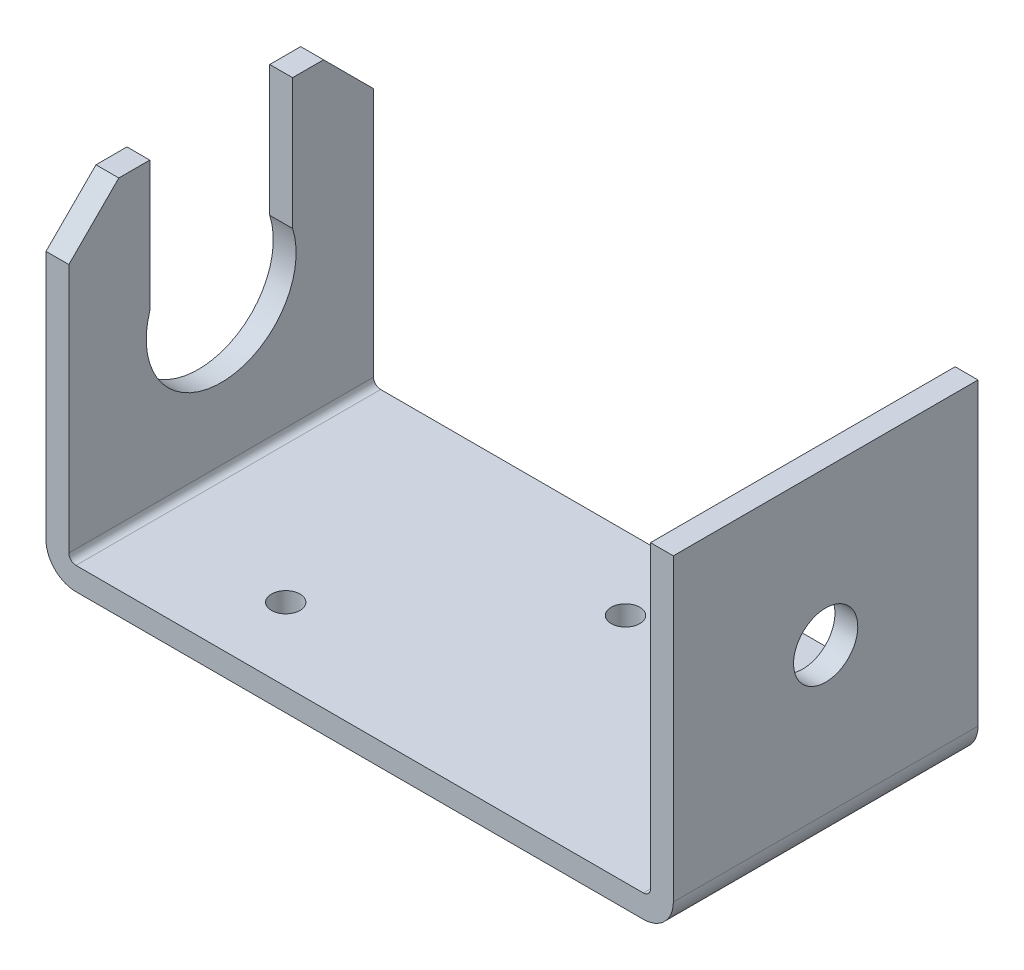
ISO-10303-21;
HEADER;
FILE_DESCRIPTION(('STEP AP214'),'2;1');
FILE_NAME('part.step','',(''),(''),'','','');
FILE_SCHEMA(('AUTOMOTIVE_DESIGN { 1 0 10303 214 1 1 1 1 }'));
ENDSEC;
DATA;
#1=APPLICATION_CONTEXT('core data for automotive mechanical design processes');
#2=APPLICATION_PROTOCOL_DEFINITION('international standard','automotive_design',2000,#1);
#3=PRODUCT_CONTEXT('',#1,'mechanical');
#4=PRODUCT('Part','Part','',(#3));
#5=PRODUCT_RELATED_PRODUCT_CATEGORY('part','',(#4));
#6=PRODUCT_DEFINITION_FORMATION('','',#4);
#7=PRODUCT_DEFINITION_CONTEXT('part definition',#1,'design');
#8=PRODUCT_DEFINITION('design','',#6,#7);
#9=PRODUCT_DEFINITION_SHAPE('','',#8);
#10=(LENGTH_UNIT() NAMED_UNIT(*) SI_UNIT(.MILLI.,.METRE.));
#11=(NAMED_UNIT(*) PLANE_ANGLE_UNIT() SI_UNIT($,.RADIAN.));
#12=(NAMED_UNIT(*) SI_UNIT($,.STERADIAN.) SOLID_ANGLE_UNIT());
#13=UNCERTAINTY_MEASURE_WITH_UNIT(LENGTH_MEASURE(1.E-05),#10,'distance_accuracy_value','');
#14=(GEOMETRIC_REPRESENTATION_CONTEXT(3) GLOBAL_UNCERTAINTY_ASSIGNED_CONTEXT((#13)) GLOBAL_UNIT_ASSIGNED_CONTEXT((#10,
#11,#12)) REPRESENTATION_CONTEXT('',''));
#15=CARTESIAN_POINT('',(0.,0.,0.));
#16=DIRECTION('',(0.,0.,1.));
#17=DIRECTION('',(1.,0.,0.));
#18=AXIS2_PLACEMENT_3D('',#15,#16,#17);
#19=CARTESIAN_POINT('',(20.37,10.75,21.34));
#20=DIRECTION('',(0.,-1.,0.));
#21=DIRECTION('',(0.,0.,-1.));
#22=AXIS2_PLACEMENT_3D('',#19,#20,#21);
#23=PLANE('',#22);
#24=DIRECTION('',(1.,0.,0.));
#25=VECTOR('',#24,1.);
#26=CARTESIAN_POINT('',(20.37,10.75,21.34));
#27=LINE('',#26,#25);
#28=CARTESIAN_POINT('',(21.97,10.75,21.34));
#29=VERTEX_POINT('',#28);
#30=CARTESIAN_POINT('',(20.37,10.75,21.34));
#31=VERTEX_POINT('',#30);
#32=EDGE_CURVE('E221',#29,#31,#27,.F.);
#33=ORIENTED_EDGE('',*,*,#32,.F.);
#34=DIRECTION('',(0.,0.,1.));
#35=VECTOR('',#34,1.);
#36=CARTESIAN_POINT('',(21.97,10.75,21.34));
#37=LINE('',#36,#35);
#38=CARTESIAN_POINT('',(21.97,10.75,0.));
#39=VERTEX_POINT('',#38);
#40=EDGE_CURVE('E300',#29,#39,#37,.F.);
#41=ORIENTED_EDGE('',*,*,#40,.T.);
#42=DIRECTION('',(1.,0.,0.));
#43=VECTOR('',#42,1.);
#44=CARTESIAN_POINT('',(20.37,10.75,0.));
#45=LINE('',#44,#43);
#46=CARTESIAN_POINT('',(20.37,10.75,0.));
#47=VERTEX_POINT('',#46);
#48=EDGE_CURVE('E153',#47,#39,#45,.T.);
#49=ORIENTED_EDGE('',*,*,#48,.F.);
#50=DIRECTION('',(0.,0.,1.));
#51=VECTOR('',#50,1.);
#52=CARTESIAN_POINT('',(20.37,10.75,21.34));
#53=LINE('',#52,#51);
#54=EDGE_CURVE('E311',#47,#31,#53,.T.);
#55=ORIENTED_EDGE('',*,*,#54,.T.);
#56=EDGE_LOOP('',(#33,#41,#49,#55));
#57=FACE_BOUND('',#56,.T.);
#58=ADVANCED_FACE('F16',(#57),#23,.F.);
#59=CARTESIAN_POINT('',(11.97,0.,10.67));
#60=DIRECTION('',(1.,0.,0.));
#61=DIRECTION('',(0.,1.,0.));
#62=AXIS2_PLACEMENT_3D('',#59,#60,#61);
#63=CYLINDRICAL_SURFACE('',#62,2.25);
#64=CARTESIAN_POINT('',(20.37,0.,10.67));
#65=DIRECTION('',(1.,0.,0.));
#66=DIRECTION('',(0.,1.,0.));
#67=AXIS2_PLACEMENT_3D('',#64,#65,#66);
#68=CIRCLE('',#67,2.25);
#69=CARTESIAN_POINT('',(20.37,2.25000000000001,10.67));
#70=VERTEX_POINT('',#69);
#71=EDGE_CURVE('E19',#70,#70,#68,.F.);
#72=ORIENTED_EDGE('',*,*,#71,.T.);
#73=EDGE_LOOP('',(#72));
#74=FACE_BOUND('',#73,.T.);
#75=CARTESIAN_POINT('',(21.97,0.,10.67));
#76=DIRECTION('',(1.,0.,0.));
#77=DIRECTION('',(0.,1.,0.));
#78=AXIS2_PLACEMENT_3D('',#75,#76,#77);
#79=CIRCLE('',#78,2.25);
#80=CARTESIAN_POINT('',(21.97,2.25000000000001,10.67));
#81=VERTEX_POINT('',#80);
#82=EDGE_CURVE('E296',#81,#81,#79,.T.);
#83=ORIENTED_EDGE('',*,*,#82,.T.);
#84=EDGE_LOOP('',(#83));
#85=FACE_BOUND('',#84,.T.);
#86=ADVANCED_FACE('F538',(#74,#85),#63,.F.);
#87=CARTESIAN_POINT('',(-21.97,10.75,21.34));
#88=DIRECTION('',(0.,-1.,0.));
#89=DIRECTION('',(0.,0.,-1.));
#90=AXIS2_PLACEMENT_3D('',#87,#88,#89);
#91=PLANE('',#90);
#92=DIRECTION('',(0.,0.,1.));
#93=VECTOR('',#92,1.);
#94=CARTESIAN_POINT('',(-20.37,10.75,21.34));
#95=LINE('',#94,#93);
#96=CARTESIAN_POINT('',(-20.37,10.75,17.84));
#97=VERTEX_POINT('',#96);
#98=CARTESIAN_POINT('',(-20.37,10.75,15.67));
#99=VERTEX_POINT('',#98);
#100=EDGE_CURVE('E345',#97,#99,#95,.F.);
#101=ORIENTED_EDGE('',*,*,#100,.T.);
#102=DIRECTION('',(1.,0.,0.));
#103=VECTOR('',#102,1.);
#104=CARTESIAN_POINT('',(-30.37,10.75,15.67));
#105=LINE('',#104,#103);
#106=CARTESIAN_POINT('',(-21.97,10.75,15.67));
#107=VERTEX_POINT('',#106);
#108=EDGE_CURVE('E218',#99,#107,#105,.F.);
#109=ORIENTED_EDGE('',*,*,#108,.T.);
#110=DIRECTION('',(0.,0.,-1.));
#111=VECTOR('',#110,1.);
#112=CARTESIAN_POINT('',(-21.97,10.75,21.34));
#113=LINE('',#112,#111);
#114=CARTESIAN_POINT('',(-21.97,10.75,17.84));
#115=VERTEX_POINT('',#114);
#116=EDGE_CURVE('E224',#107,#115,#113,.F.);
#117=ORIENTED_EDGE('',*,*,#116,.T.);
#118=DIRECTION('',(1.,0.,0.));
#119=VECTOR('',#118,1.);
#120=CARTESIAN_POINT('',(-19.87,10.75,17.84));
#121=LINE('',#120,#119);
#122=EDGE_CURVE('E318',#115,#97,#121,.T.);
#123=ORIENTED_EDGE('',*,*,#122,.T.);
#124=EDGE_LOOP('',(#101,#109,#117,#123));
#125=FACE_BOUND('',#124,.T.);
#126=ADVANCED_FACE('F478',(#125),#91,.F.);
#127=CARTESIAN_POINT('',(-30.37,13.3513775928379,15.67));
#128=DIRECTION('',(0.,0.,1.));
#129=DIRECTION('',(1.,0.,0.));
#130=AXIS2_PLACEMENT_3D('',#127,#128,#129);
#131=PLANE('',#130);
#132=DIRECTION('',(0.,1.,0.));
#133=VECTOR('',#132,1.);
#134=CARTESIAN_POINT('',(-21.97,10.75,15.67));
#135=LINE('',#134,#133);
#136=CARTESIAN_POINT('',(-21.97,1.6007810593582,15.67));
#137=VERTEX_POINT('',#136);
#138=EDGE_CURVE('E229',#137,#107,#135,.T.);
#139=ORIENTED_EDGE('',*,*,#138,.T.);
#140=ORIENTED_EDGE('',*,*,#108,.F.);
#141=DIRECTION('',(0.,-1.,0.));
#142=VECTOR('',#141,1.);
#143=CARTESIAN_POINT('',(-20.37,10.75,15.67));
#144=LINE('',#143,#142);
#145=CARTESIAN_POINT('',(-20.37,1.6007810593582,15.67));
#146=VERTEX_POINT('',#145);
#147=EDGE_CURVE('E293',#99,#146,#144,.T.);
#148=ORIENTED_EDGE('',*,*,#147,.T.);
#149=DIRECTION('',(1.,0.,0.));
#150=VECTOR('',#149,1.);
#151=CARTESIAN_POINT('',(-30.37,1.6007810593582,15.67));
#152=LINE('',#151,#150);
#153=EDGE_CURVE('E215',#146,#137,#152,.F.);
#154=ORIENTED_EDGE('',*,*,#153,.T.);
#155=EDGE_LOOP('',(#139,#140,#148,#154));
#156=FACE_BOUND('',#155,.T.);
#157=ADVANCED_FACE('F546',(#156),#131,.F.);
#158=CARTESIAN_POINT('',(-30.37,0.,10.67));
#159=DIRECTION('',(1.,0.,0.));
#160=DIRECTION('',(0.,1.,0.));
#161=AXIS2_PLACEMENT_3D('',#158,#159,#160);
#162=CYLINDRICAL_SURFACE('',#161,5.25);
#163=DIRECTION('',(1.,0.,0.));
#164=VECTOR('',#163,1.);
#165=CARTESIAN_POINT('',(-30.37,1.6007810593582,5.67));
#166=LINE('',#165,#164);
#167=CARTESIAN_POINT('',(-20.37,1.60078105935821,5.67));
#168=VERTEX_POINT('',#167);
#169=CARTESIAN_POINT('',(-21.97,1.6007810593582,5.67));
#170=VERTEX_POINT('',#169);
#171=EDGE_CURVE('E114',#168,#170,#166,.F.);
#172=ORIENTED_EDGE('',*,*,#171,.T.);
#173=CARTESIAN_POINT('',(-21.97,0.,10.67));
#174=DIRECTION('',(1.,0.,0.));
#175=DIRECTION('',(0.,1.,0.));
#176=AXIS2_PLACEMENT_3D('',#173,#174,#175);
#177=CIRCLE('',#176,5.25);
#178=EDGE_CURVE('E294',#170,#137,#177,.F.);
#179=ORIENTED_EDGE('',*,*,#178,.T.);
#180=ORIENTED_EDGE('',*,*,#153,.F.);
#181=CARTESIAN_POINT('',(-20.37,0.,10.67));
#182=DIRECTION('',(1.,0.,0.));
#183=DIRECTION('',(0.,1.,0.));
#184=AXIS2_PLACEMENT_3D('',#181,#182,#183);
#185=CIRCLE('',#184,5.25);
#186=EDGE_CURVE('E203',#146,#168,#185,.T.);
#187=ORIENTED_EDGE('',*,*,#186,.T.);
#188=EDGE_LOOP('',(#172,#179,#180,#187));
#189=FACE_BOUND('',#188,.T.);
#190=ADVANCED_FACE('F551',(#189),#162,.F.);
#191=CARTESIAN_POINT('',(-30.37,13.3513775928379,5.67));
#192=DIRECTION('',(0.,0.,-1.));
#193=DIRECTION('',(0.,1.,0.));
#194=AXIS2_PLACEMENT_3D('',#191,#192,#193);
#195=PLANE('',#194);
#196=DIRECTION('',(0.,-1.,0.));
#197=VECTOR('',#196,1.);
#198=CARTESIAN_POINT('',(-20.37,10.75,5.67));
#199=LINE('',#198,#197);
#200=CARTESIAN_POINT('',(-20.37,10.75,5.67));
#201=VERTEX_POINT('',#200);
#202=EDGE_CURVE('E198',#168,#201,#199,.F.);
#203=ORIENTED_EDGE('',*,*,#202,.T.);
#204=DIRECTION('',(1.,0.,0.));
#205=VECTOR('',#204,1.);
#206=CARTESIAN_POINT('',(-21.97,10.75,5.67));
#207=LINE('',#206,#205);
#208=CARTESIAN_POINT('',(-21.97,10.75,5.67));
#209=VERTEX_POINT('',#208);
#210=EDGE_CURVE('E129',#201,#209,#207,.F.);
#211=ORIENTED_EDGE('',*,*,#210,.T.);
#212=DIRECTION('',(0.,1.,0.));
#213=VECTOR('',#212,1.);
#214=CARTESIAN_POINT('',(-21.97,10.75,5.67));
#215=LINE('',#214,#213);
#216=EDGE_CURVE('E235',#209,#170,#215,.F.);
#217=ORIENTED_EDGE('',*,*,#216,.T.);
#218=ORIENTED_EDGE('',*,*,#171,.F.);
#219=EDGE_LOOP('',(#203,#211,#217,#218));
#220=FACE_BOUND('',#219,.T.);
#221=ADVANCED_FACE('F555',(#220),#195,.F.);
#222=CARTESIAN_POINT('',(-21.97,10.75,21.34));
#223=DIRECTION('',(0.,-1.,0.));
#224=DIRECTION('',(0.,0.,-1.));
#225=AXIS2_PLACEMENT_3D('',#222,#223,#224);
#226=PLANE('',#225);
#227=DIRECTION('',(0.,0.,-1.));
#228=VECTOR('',#227,1.);
#229=CARTESIAN_POINT('',(-21.97,10.75,21.34));
#230=LINE('',#229,#228);
#231=CARTESIAN_POINT('',(-21.97,10.75,3.50000000000001));
#232=VERTEX_POINT('',#231);
#233=EDGE_CURVE('E232',#232,#209,#230,.F.);
#234=ORIENTED_EDGE('',*,*,#233,.T.);
#235=ORIENTED_EDGE('',*,*,#210,.F.);
#236=DIRECTION('',(0.,0.,1.));
#237=VECTOR('',#236,1.);
#238=CARTESIAN_POINT('',(-20.37,10.75,21.34));
#239=LINE('',#238,#237);
#240=CARTESIAN_POINT('',(-20.37,10.75,3.50000000000001));
#241=VERTEX_POINT('',#240);
#242=EDGE_CURVE('E190',#201,#241,#239,.F.);
#243=ORIENTED_EDGE('',*,*,#242,.T.);
#244=DIRECTION('',(1.,0.,0.));
#245=VECTOR('',#244,1.);
#246=CARTESIAN_POINT('',(-21.97,10.75,3.50000000000001));
#247=LINE('',#246,#245);
#248=EDGE_CURVE('E173',#232,#241,#247,.T.);
#249=ORIENTED_EDGE('',*,*,#248,.F.);
#250=EDGE_LOOP('',(#234,#235,#243,#249));
#251=FACE_BOUND('',#250,.T.);
#252=ADVANCED_FACE('F196',(#251),#226,.F.);
#253=CARTESIAN_POINT('',(-21.97,10.75,3.5));
#254=DIRECTION('',(0.,0.707106781186546,-0.707106781186549));
#255=DIRECTION('',(0.,0.707106781186549,0.707106781186546));
#256=AXIS2_PLACEMENT_3D('',#253,#254,#255);
#257=PLANE('',#256);
#258=DIRECTION('',(0.,-0.707106781186549,-0.707106781186547));
#259=VECTOR('',#258,1.);
#260=CARTESIAN_POINT('',(-20.37,10.75,3.50000000000001));
#261=LINE('',#260,#259);
#262=CARTESIAN_POINT('',(-20.37,7.24999999999998,0.));
#263=VERTEX_POINT('',#262);
#264=EDGE_CURVE('E176',#241,#263,#261,.T.);
#265=ORIENTED_EDGE('',*,*,#264,.T.);
#266=DIRECTION('',(1.,0.,0.));
#267=VECTOR('',#266,1.);
#268=CARTESIAN_POINT('',(-21.97,7.24999999999998,0.));
#269=LINE('',#268,#267);
#270=CARTESIAN_POINT('',(-21.97,7.24999999999998,0.));
#271=VERTEX_POINT('',#270);
#272=EDGE_CURVE('E165',#263,#271,#269,.F.);
#273=ORIENTED_EDGE('',*,*,#272,.T.);
#274=DIRECTION('',(0.,0.707106781186549,0.707106781186546));
#275=VECTOR('',#274,1.);
#276=CARTESIAN_POINT('',(-21.97,7.24999999999998,0.));
#277=LINE('',#276,#275);
#278=EDGE_CURVE('E179',#271,#232,#277,.T.);
#279=ORIENTED_EDGE('',*,*,#278,.T.);
#280=ORIENTED_EDGE('',*,*,#248,.T.);
#281=EDGE_LOOP('',(#265,#273,#279,#280));
#282=FACE_BOUND('',#281,.T.);
#283=ADVANCED_FACE('F175',(#282),#257,.T.);
#284=CARTESIAN_POINT('',(-19.87,7.25,21.34));
#285=DIRECTION('',(0.,-0.707106781186549,-0.707106781186546));
#286=DIRECTION('',(0.,0.707106781186546,-0.707106781186549));
#287=AXIS2_PLACEMENT_3D('',#284,#285,#286);
#288=PLANE('',#287);
#289=DIRECTION('',(0.,-0.707106781186546,0.707106781186549));
#290=VECTOR('',#289,1.);
#291=CARTESIAN_POINT('',(-21.97,10.75,17.84));
#292=LINE('',#291,#290);
#293=CARTESIAN_POINT('',(-21.97,7.25,21.34));
#294=VERTEX_POINT('',#293);
#295=EDGE_CURVE('E228',#115,#294,#292,.T.);
#296=ORIENTED_EDGE('',*,*,#295,.T.);
#297=DIRECTION('',(1.,0.,0.));
#298=VECTOR('',#297,1.);
#299=CARTESIAN_POINT('',(-19.87,7.25,21.34));
#300=LINE('',#299,#298);
#301=CARTESIAN_POINT('',(-20.37,7.25,21.34));
#302=VERTEX_POINT('',#301);
#303=EDGE_CURVE('E334',#302,#294,#300,.F.);
#304=ORIENTED_EDGE('',*,*,#303,.F.);
#305=DIRECTION('',(0.,0.707106781186546,-0.707106781186549));
#306=VECTOR('',#305,1.);
#307=CARTESIAN_POINT('',(-20.37,7.25,21.34));
#308=LINE('',#307,#306);
#309=EDGE_CURVE('E194',#302,#97,#308,.T.);
#310=ORIENTED_EDGE('',*,*,#309,.T.);
#311=ORIENTED_EDGE('',*,*,#122,.F.);
#312=EDGE_LOOP('',(#296,#304,#310,#311));
#313=FACE_BOUND('',#312,.T.);
#314=ADVANCED_FACE('F480',(#313),#288,.F.);
#315=CARTESIAN_POINT('',(20.37,10.75,21.34));
#316=DIRECTION('',(1.,0.,0.));
#317=DIRECTION('',(0.,1.,0.));
#318=AXIS2_PLACEMENT_3D('',#315,#316,#317);
#319=PLANE('',#318);
#320=ORIENTED_EDGE('',*,*,#71,.F.);
#321=EDGE_LOOP('',(#320));
#322=FACE_BOUND('',#321,.T.);
#323=DIRECTION('',(0.,1.,0.));
#324=VECTOR('',#323,1.);
#325=CARTESIAN_POINT('',(20.37,-10.25,21.34));
#326=LINE('',#325,#324);
#327=CARTESIAN_POINT('',(20.37,-10.25,21.34));
#328=VERTEX_POINT('',#327);
#329=EDGE_CURVE('E275',#328,#31,#326,.T.);
#330=ORIENTED_EDGE('',*,*,#329,.T.);
#331=ORIENTED_EDGE('',*,*,#54,.F.);
#332=DIRECTION('',(0.,1.,0.));
#333=VECTOR('',#332,1.);
#334=CARTESIAN_POINT('',(20.37,-10.25,0.));
#335=LINE('',#334,#333);
#336=CARTESIAN_POINT('',(20.37,-10.25,0.));
#337=VERTEX_POINT('',#336);
#338=EDGE_CURVE('E365',#337,#47,#335,.T.);
#339=ORIENTED_EDGE('',*,*,#338,.F.);
#340=DIRECTION('',(0.,0.,-1.));
#341=VECTOR('',#340,1.);
#342=CARTESIAN_POINT('',(20.37,-10.25,21.34));
#343=LINE('',#342,#341);
#344=EDGE_CURVE('E281',#337,#328,#343,.F.);
#345=ORIENTED_EDGE('',*,*,#344,.T.);
#346=EDGE_LOOP('',(#330,#331,#339,#345));
#347=FACE_BOUND('',#346,.T.);
#348=ADVANCED_FACE('F452',(#322,#347),#319,.F.);
#349=CARTESIAN_POINT('',(21.97,10.75,21.34));
#350=DIRECTION('',(-1.,0.,0.));
#351=DIRECTION('',(0.,-1.,0.));
#352=AXIS2_PLACEMENT_3D('',#349,#350,#351);
#353=PLANE('',#352);
#354=ORIENTED_EDGE('',*,*,#82,.F.);
#355=EDGE_LOOP('',(#354));
#356=FACE_BOUND('',#355,.T.);
#357=DIRECTION('',(0.,1.,0.));
#358=VECTOR('',#357,1.);
#359=CARTESIAN_POINT('',(21.97,-10.25,21.34));
#360=LINE('',#359,#358);
#361=CARTESIAN_POINT('',(21.97,-10.25,21.34));
#362=VERTEX_POINT('',#361);
#363=EDGE_CURVE('E270',#29,#362,#360,.F.);
#364=ORIENTED_EDGE('',*,*,#363,.T.);
#365=DIRECTION('',(0.,0.,-1.));
#366=VECTOR('',#365,1.);
#367=CARTESIAN_POINT('',(21.97,-10.25,21.34));
#368=LINE('',#367,#366);
#369=CARTESIAN_POINT('',(21.97,-10.25,0.));
#370=VERTEX_POINT('',#369);
#371=EDGE_CURVE('E299',#370,#362,#368,.F.);
#372=ORIENTED_EDGE('',*,*,#371,.F.);
#373=DIRECTION('',(0.,1.,0.));
#374=VECTOR('',#373,1.);
#375=CARTESIAN_POINT('',(21.97,-10.25,0.));
#376=LINE('',#375,#374);
#377=EDGE_CURVE('E286',#39,#370,#376,.F.);
#378=ORIENTED_EDGE('',*,*,#377,.F.);
#379=ORIENTED_EDGE('',*,*,#40,.F.);
#380=EDGE_LOOP('',(#364,#372,#378,#379));
#381=FACE_BOUND('',#380,.T.);
#382=ADVANCED_FACE('F489',(#356,#381),#353,.F.);
#383=CARTESIAN_POINT('',(19.87,-10.25,21.34));
#384=DIRECTION('',(0.,0.,-1.));
#385=DIRECTION('',(-1.,0.,0.));
#386=AXIS2_PLACEMENT_3D('',#383,#384,#385);
#387=CYLINDRICAL_SURFACE('',#386,2.1);
#388=CARTESIAN_POINT('',(19.87,-10.25,0.));
#389=DIRECTION('',(0.,0.,-1.));
#390=DIRECTION('',(-1.,0.,0.));
#391=AXIS2_PLACEMENT_3D('',#388,#389,#390);
#392=CIRCLE('',#391,2.1);
#393=CARTESIAN_POINT('',(19.87,-12.35,0.));
#394=VERTEX_POINT('',#393);
#395=EDGE_CURVE('E282',#370,#394,#392,.T.);
#396=ORIENTED_EDGE('',*,*,#395,.F.);
#397=ORIENTED_EDGE('',*,*,#371,.T.);
#398=CARTESIAN_POINT('',(19.87,-10.25,21.34));
#399=DIRECTION('',(0.,0.,-1.));
#400=DIRECTION('',(-1.,0.,0.));
#401=AXIS2_PLACEMENT_3D('',#398,#399,#400);
#402=CIRCLE('',#401,2.1);
#403=CARTESIAN_POINT('',(19.87,-12.35,21.34));
#404=VERTEX_POINT('',#403);
#405=EDGE_CURVE('E266',#362,#404,#402,.T.);
#406=ORIENTED_EDGE('',*,*,#405,.T.);
#407=DIRECTION('',(0.,0.,1.));
#408=VECTOR('',#407,1.);
#409=CARTESIAN_POINT('',(19.87,-12.35,21.34));
#410=LINE('',#409,#408);
#411=EDGE_CURVE('E373',#404,#394,#410,.F.);
#412=ORIENTED_EDGE('',*,*,#411,.T.);
#413=EDGE_LOOP('',(#396,#397,#406,#412));
#414=FACE_BOUND('',#413,.T.);
#415=ADVANCED_FACE('F527',(#414),#387,.T.);
#416=CARTESIAN_POINT('',(-19.87,-10.25,21.34));
#417=DIRECTION('',(0.,0.,-1.));
#418=DIRECTION('',(-1.,0.,0.));
#419=AXIS2_PLACEMENT_3D('',#416,#417,#418);
#420=CYLINDRICAL_SURFACE('',#419,2.1);
#421=CARTESIAN_POINT('',(-19.87,-10.25,0.));
#422=DIRECTION('',(0.,0.,-1.));
#423=DIRECTION('',(-1.,0.,0.));
#424=AXIS2_PLACEMENT_3D('',#421,#422,#423);
#425=CIRCLE('',#424,2.1);
#426=CARTESIAN_POINT('',(-19.87,-12.35,0.));
#427=VERTEX_POINT('',#426);
#428=CARTESIAN_POINT('',(-21.97,-10.25,0.));
#429=VERTEX_POINT('',#428);
#430=EDGE_CURVE('E287',#427,#429,#425,.T.);
#431=ORIENTED_EDGE('',*,*,#430,.F.);
#432=DIRECTION('',(0.,0.,1.));
#433=VECTOR('',#432,1.);
#434=CARTESIAN_POINT('',(-19.87,-12.35,21.34));
#435=LINE('',#434,#433);
#436=CARTESIAN_POINT('',(-19.87,-12.35,21.34));
#437=VERTEX_POINT('',#436);
#438=EDGE_CURVE('E326',#427,#437,#435,.T.);
#439=ORIENTED_EDGE('',*,*,#438,.T.);
#440=CARTESIAN_POINT('',(-19.87,-10.25,21.34));
#441=DIRECTION('',(0.,0.,-1.));
#442=DIRECTION('',(-1.,0.,0.));
#443=AXIS2_PLACEMENT_3D('',#440,#441,#442);
#444=CIRCLE('',#443,2.1);
#445=CARTESIAN_POINT('',(-21.97,-10.25,21.34));
#446=VERTEX_POINT('',#445);
#447=EDGE_CURVE('E262',#437,#446,#444,.T.);
#448=ORIENTED_EDGE('',*,*,#447,.T.);
#449=DIRECTION('',(0.,0.,-1.));
#450=VECTOR('',#449,1.);
#451=CARTESIAN_POINT('',(-21.97,-10.25,21.34));
#452=LINE('',#451,#450);
#453=EDGE_CURVE('E305',#446,#429,#452,.T.);
#454=ORIENTED_EDGE('',*,*,#453,.T.);
#455=EDGE_LOOP('',(#431,#439,#448,#454));
#456=FACE_BOUND('',#455,.T.);
#457=ADVANCED_FACE('F401',(#456),#420,.T.);
#458=CARTESIAN_POINT('',(-21.97,10.75,21.34));
#459=DIRECTION('',(1.,0.,0.));
#460=DIRECTION('',(0.,0.,-1.));
#461=AXIS2_PLACEMENT_3D('',#458,#459,#460);
#462=PLANE('',#461);
#463=ORIENTED_EDGE('',*,*,#116,.F.);
#464=ORIENTED_EDGE('',*,*,#138,.F.);
#465=ORIENTED_EDGE('',*,*,#178,.F.);
#466=ORIENTED_EDGE('',*,*,#216,.F.);
#467=ORIENTED_EDGE('',*,*,#233,.F.);
#468=ORIENTED_EDGE('',*,*,#278,.F.);
#469=DIRECTION('',(0.,1.,0.));
#470=VECTOR('',#469,1.);
#471=CARTESIAN_POINT('',(-21.97,-10.25,0.));
#472=LINE('',#471,#470);
#473=EDGE_CURVE('E289',#429,#271,#472,.T.);
#474=ORIENTED_EDGE('',*,*,#473,.F.);
#475=ORIENTED_EDGE('',*,*,#453,.F.);
#476=DIRECTION('',(0.,1.,0.));
#477=VECTOR('',#476,1.);
#478=CARTESIAN_POINT('',(-21.97,-10.25,21.34));
#479=LINE('',#478,#477);
#480=EDGE_CURVE('E261',#446,#294,#479,.T.);
#481=ORIENTED_EDGE('',*,*,#480,.T.);
#482=ORIENTED_EDGE('',*,*,#295,.F.);
#483=EDGE_LOOP('',(#463,#464,#465,#466,#467,#468,#474,#475,#481,#482));
#484=FACE_BOUND('',#483,.T.);
#485=ADVANCED_FACE('F359',(#484),#462,.F.);
#486=CARTESIAN_POINT('',(-20.37,10.75,21.34));
#487=DIRECTION('',(-1.,0.,0.));
#488=DIRECTION('',(0.,-1.,0.));
#489=AXIS2_PLACEMENT_3D('',#486,#487,#488);
#490=PLANE('',#489);
#491=DIRECTION('',(0.,1.,0.));
#492=VECTOR('',#491,1.);
#493=CARTESIAN_POINT('',(-20.37,-10.25,21.34));
#494=LINE('',#493,#492);
#495=CARTESIAN_POINT('',(-20.37,-10.25,21.34));
#496=VERTEX_POINT('',#495);
#497=EDGE_CURVE('E276',#302,#496,#494,.F.);
#498=ORIENTED_EDGE('',*,*,#497,.T.);
#499=DIRECTION('',(0.,0.,-1.));
#500=VECTOR('',#499,1.);
#501=CARTESIAN_POINT('',(-20.37,-10.25,21.34));
#502=LINE('',#501,#500);
#503=CARTESIAN_POINT('',(-20.37,-10.25,0.));
#504=VERTEX_POINT('',#503);
#505=EDGE_CURVE('E256',#496,#504,#502,.T.);
#506=ORIENTED_EDGE('',*,*,#505,.T.);
#507=DIRECTION('',(0.,1.,0.));
#508=VECTOR('',#507,1.);
#509=CARTESIAN_POINT('',(-20.37,-10.25,0.));
#510=LINE('',#509,#508);
#511=EDGE_CURVE('E192',#263,#504,#510,.F.);
#512=ORIENTED_EDGE('',*,*,#511,.F.);
#513=ORIENTED_EDGE('',*,*,#264,.F.);
#514=ORIENTED_EDGE('',*,*,#242,.F.);
#515=ORIENTED_EDGE('',*,*,#202,.F.);
#516=ORIENTED_EDGE('',*,*,#186,.F.);
#517=ORIENTED_EDGE('',*,*,#147,.F.);
#518=ORIENTED_EDGE('',*,*,#100,.F.);
#519=ORIENTED_EDGE('',*,*,#309,.F.);
#520=EDGE_LOOP('',(#498,#506,#512,#513,#514,#515,#516,#517,#518,#519));
#521=FACE_BOUND('',#520,.T.);
#522=ADVANCED_FACE('F188',(#521),#490,.F.);
#523=CARTESIAN_POINT('',(-19.87,-12.35,21.34));
#524=DIRECTION('',(0.,1.,0.));
#525=DIRECTION('',(0.,0.,1.));
#526=AXIS2_PLACEMENT_3D('',#523,#524,#525);
#527=PLANE('',#526);
#528=CARTESIAN_POINT('',(2.41,-12.35,5.13));
#529=DIRECTION('',(0.,1.,0.));
#530=DIRECTION('',(-1.,0.,0.));
#531=AXIS2_PLACEMENT_3D('',#528,#529,#530);
#532=CIRCLE('',#531,1.);
#533=CARTESIAN_POINT('',(1.40999999999999,-12.35,5.13));
#534=VERTEX_POINT('',#533);
#535=EDGE_CURVE('E248',#534,#534,#532,.T.);
#536=ORIENTED_EDGE('',*,*,#535,.T.);
#537=EDGE_LOOP('',(#536));
#538=FACE_BOUND('',#537,.T.);
#539=CARTESIAN_POINT('',(-10.29,-12.35,16.23));
#540=DIRECTION('',(0.,1.,0.));
#541=DIRECTION('',(-1.,0.,0.));
#542=AXIS2_PLACEMENT_3D('',#539,#540,#541);
#543=CIRCLE('',#542,1.);
#544=CARTESIAN_POINT('',(-11.29,-12.35,16.23));
#545=VERTEX_POINT('',#544);
#546=EDGE_CURVE('E253',#545,#545,#543,.T.);
#547=ORIENTED_EDGE('',*,*,#546,.T.);
#548=EDGE_LOOP('',(#547));
#549=FACE_BOUND('',#548,.T.);
#550=DIRECTION('',(-1.,0.,0.));
#551=VECTOR('',#550,1.);
#552=CARTESIAN_POINT('',(-19.87,-12.35,21.34));
#553=LINE('',#552,#551);
#554=EDGE_CURVE('E265',#404,#437,#553,.T.);
#555=ORIENTED_EDGE('',*,*,#554,.T.);
#556=ORIENTED_EDGE('',*,*,#438,.F.);
#557=DIRECTION('',(-1.,0.,0.));
#558=VECTOR('',#557,1.);
#559=CARTESIAN_POINT('',(-19.87,-12.35,0.));
#560=LINE('',#559,#558);
#561=EDGE_CURVE('E290',#394,#427,#560,.T.);
#562=ORIENTED_EDGE('',*,*,#561,.F.);
#563=ORIENTED_EDGE('',*,*,#411,.F.);
#564=EDGE_LOOP('',(#555,#556,#562,#563));
#565=FACE_BOUND('',#564,.T.);
#566=ADVANCED_FACE('F411',(#538,#549,#565),#527,.F.);
#567=CARTESIAN_POINT('',(-19.87,-10.25,0.));
#568=DIRECTION('',(0.,0.,-1.));
#569=DIRECTION('',(-1.,0.,0.));
#570=AXIS2_PLACEMENT_3D('',#567,#568,#569);
#571=PLANE('',#570);
#572=ORIENTED_EDGE('',*,*,#377,.T.);
#573=ORIENTED_EDGE('',*,*,#395,.T.);
#574=ORIENTED_EDGE('',*,*,#561,.T.);
#575=ORIENTED_EDGE('',*,*,#430,.T.);
#576=ORIENTED_EDGE('',*,*,#473,.T.);
#577=ORIENTED_EDGE('',*,*,#272,.F.);
#578=ORIENTED_EDGE('',*,*,#511,.T.);
#579=CARTESIAN_POINT('',(-19.87,-10.25,0.));
#580=DIRECTION('',(0.,0.,-1.));
#581=DIRECTION('',(-1.,0.,0.));
#582=AXIS2_PLACEMENT_3D('',#579,#580,#581);
#583=CIRCLE('',#582,0.500000000000004);
#584=CARTESIAN_POINT('',(-19.87,-10.75,0.));
#585=VERTEX_POINT('',#584);
#586=EDGE_CURVE('E258',#504,#585,#583,.F.);
#587=ORIENTED_EDGE('',*,*,#586,.T.);
#588=DIRECTION('',(1.,0.,0.));
#589=VECTOR('',#588,1.);
#590=CARTESIAN_POINT('',(-19.87,-10.75,0.));
#591=LINE('',#590,#589);
#592=CARTESIAN_POINT('',(19.87,-10.75,0.));
#593=VERTEX_POINT('',#592);
#594=EDGE_CURVE('E252',#585,#593,#591,.T.);
#595=ORIENTED_EDGE('',*,*,#594,.T.);
#596=CARTESIAN_POINT('',(19.87,-10.25,0.));
#597=DIRECTION('',(0.,0.,-1.));
#598=DIRECTION('',(-1.,0.,0.));
#599=AXIS2_PLACEMENT_3D('',#596,#597,#598);
#600=CIRCLE('',#599,0.5);
#601=EDGE_CURVE('E277',#593,#337,#600,.F.);
#602=ORIENTED_EDGE('',*,*,#601,.T.);
#603=ORIENTED_EDGE('',*,*,#338,.T.);
#604=ORIENTED_EDGE('',*,*,#48,.T.);
#605=EDGE_LOOP('',(#572,#573,#574,#575,#576,#577,#578,#587,#595,#602,#603,#604));
#606=FACE_BOUND('',#605,.T.);
#607=ADVANCED_FACE('F360',(#606),#571,.T.);
#608=CARTESIAN_POINT('',(19.87,-10.25,21.34));
#609=DIRECTION('',(0.,0.,-1.));
#610=DIRECTION('',(-1.,0.,0.));
#611=AXIS2_PLACEMENT_3D('',#608,#609,#610);
#612=CYLINDRICAL_SURFACE('',#611,0.5);
#613=CARTESIAN_POINT('',(19.87,-10.25,21.34));
#614=DIRECTION('',(0.,0.,-1.));
#615=DIRECTION('',(-1.,0.,0.));
#616=AXIS2_PLACEMENT_3D('',#613,#614,#615);
#617=CIRCLE('',#616,0.5);
#618=CARTESIAN_POINT('',(19.87,-10.75,21.34));
#619=VERTEX_POINT('',#618);
#620=EDGE_CURVE('E271',#619,#328,#617,.F.);
#621=ORIENTED_EDGE('',*,*,#620,.T.);
#622=ORIENTED_EDGE('',*,*,#344,.F.);
#623=ORIENTED_EDGE('',*,*,#601,.F.);
#624=DIRECTION('',(0.,0.,1.));
#625=VECTOR('',#624,1.);
#626=CARTESIAN_POINT('',(19.87,-10.75,21.34));
#627=LINE('',#626,#625);
#628=EDGE_CURVE('E433',#593,#619,#627,.T.);
#629=ORIENTED_EDGE('',*,*,#628,.T.);
#630=EDGE_LOOP('',(#621,#622,#623,#629));
#631=FACE_BOUND('',#630,.T.);
#632=ADVANCED_FACE('F455',(#631),#612,.F.);
#633=CARTESIAN_POINT('',(-19.87,-10.25,21.34));
#634=DIRECTION('',(0.,0.,-1.));
#635=DIRECTION('',(-1.,0.,0.));
#636=AXIS2_PLACEMENT_3D('',#633,#634,#635);
#637=PLANE('',#636);
#638=ORIENTED_EDGE('',*,*,#480,.F.);
#639=ORIENTED_EDGE('',*,*,#447,.F.);
#640=ORIENTED_EDGE('',*,*,#554,.F.);
#641=ORIENTED_EDGE('',*,*,#405,.F.);
#642=ORIENTED_EDGE('',*,*,#363,.F.);
#643=ORIENTED_EDGE('',*,*,#32,.T.);
#644=ORIENTED_EDGE('',*,*,#329,.F.);
#645=ORIENTED_EDGE('',*,*,#620,.F.);
#646=DIRECTION('',(1.,0.,0.));
#647=VECTOR('',#646,1.);
#648=CARTESIAN_POINT('',(-19.87,-10.75,21.34));
#649=LINE('',#648,#647);
#650=CARTESIAN_POINT('',(-19.87,-10.75,21.34));
#651=VERTEX_POINT('',#650);
#652=EDGE_CURVE('E437',#619,#651,#649,.F.);
#653=ORIENTED_EDGE('',*,*,#652,.T.);
#654=CARTESIAN_POINT('',(-19.87,-10.25,21.34));
#655=DIRECTION('',(0.,0.,-1.));
#656=DIRECTION('',(-1.,0.,0.));
#657=AXIS2_PLACEMENT_3D('',#654,#655,#656);
#658=CIRCLE('',#657,0.500000000000004);
#659=EDGE_CURVE('E35',#651,#496,#658,.T.);
#660=ORIENTED_EDGE('',*,*,#659,.T.);
#661=ORIENTED_EDGE('',*,*,#497,.F.);
#662=ORIENTED_EDGE('',*,*,#303,.T.);
#663=EDGE_LOOP('',(#638,#639,#640,#641,#642,#643,#644,#645,#653,#660,#661,#662));
#664=FACE_BOUND('',#663,.T.);
#665=ADVANCED_FACE('F408',(#664),#637,.F.);
#666=CARTESIAN_POINT('',(-19.87,-10.25,21.34));
#667=DIRECTION('',(0.,0.,-1.));
#668=DIRECTION('',(-1.,0.,0.));
#669=AXIS2_PLACEMENT_3D('',#666,#667,#668);
#670=CYLINDRICAL_SURFACE('',#669,0.500000000000004);
#671=ORIENTED_EDGE('',*,*,#659,.F.);
#672=DIRECTION('',(0.,0.,1.));
#673=VECTOR('',#672,1.);
#674=CARTESIAN_POINT('',(-19.87,-10.75,21.34));
#675=LINE('',#674,#673);
#676=EDGE_CURVE('E247',#651,#585,#675,.F.);
#677=ORIENTED_EDGE('',*,*,#676,.T.);
#678=ORIENTED_EDGE('',*,*,#586,.F.);
#679=ORIENTED_EDGE('',*,*,#505,.F.);
#680=EDGE_LOOP('',(#671,#677,#678,#679));
#681=FACE_BOUND('',#680,.T.);
#682=ADVANCED_FACE('F461',(#681),#670,.F.);
#683=CARTESIAN_POINT('',(-10.29,-20.75,16.23));
#684=DIRECTION('',(0.,1.,0.));
#685=DIRECTION('',(-1.,0.,0.));
#686=AXIS2_PLACEMENT_3D('',#683,#684,#685);
#687=CYLINDRICAL_SURFACE('',#686,1.);
#688=ORIENTED_EDGE('',*,*,#546,.F.);
#689=EDGE_LOOP('',(#688));
#690=FACE_BOUND('',#689,.T.);
#691=CARTESIAN_POINT('',(-10.29,-10.75,16.23));
#692=DIRECTION('',(0.,1.,0.));
#693=DIRECTION('',(-1.,0.,0.));
#694=AXIS2_PLACEMENT_3D('',#691,#692,#693);
#695=CIRCLE('',#694,1.);
#696=CARTESIAN_POINT('',(-11.29,-10.75,16.23));
#697=VERTEX_POINT('',#696);
#698=EDGE_CURVE('E26',#697,#697,#695,.T.);
#699=ORIENTED_EDGE('',*,*,#698,.T.);
#700=EDGE_LOOP('',(#699));
#701=FACE_BOUND('',#700,.T.);
#702=ADVANCED_FACE('F502',(#690,#701),#687,.F.);
#703=CARTESIAN_POINT('',(2.41,-20.75,5.13));
#704=DIRECTION('',(0.,1.,0.));
#705=DIRECTION('',(-1.,0.,0.));
#706=AXIS2_PLACEMENT_3D('',#703,#704,#705);
#707=CYLINDRICAL_SURFACE('',#706,1.);
#708=ORIENTED_EDGE('',*,*,#535,.F.);
#709=EDGE_LOOP('',(#708));
#710=FACE_BOUND('',#709,.T.);
#711=CARTESIAN_POINT('',(2.41,-10.75,5.13));
#712=DIRECTION('',(0.,1.,0.));
#713=DIRECTION('',(-1.,0.,0.));
#714=AXIS2_PLACEMENT_3D('',#711,#712,#713);
#715=CIRCLE('',#714,1.);
#716=CARTESIAN_POINT('',(1.40999999999999,-10.75,5.13));
#717=VERTEX_POINT('',#716);
#718=EDGE_CURVE('E11',#717,#717,#715,.T.);
#719=ORIENTED_EDGE('',*,*,#718,.T.);
#720=EDGE_LOOP('',(#719));
#721=FACE_BOUND('',#720,.T.);
#722=ADVANCED_FACE('F494',(#710,#721),#707,.F.);
#723=CARTESIAN_POINT('',(-19.87,-10.75,21.34));
#724=DIRECTION('',(0.,-1.,0.));
#725=DIRECTION('',(1.,0.,0.));
#726=AXIS2_PLACEMENT_3D('',#723,#724,#725);
#727=PLANE('',#726);
#728=ORIENTED_EDGE('',*,*,#718,.F.);
#729=EDGE_LOOP('',(#728));
#730=FACE_BOUND('',#729,.T.);
#731=ORIENTED_EDGE('',*,*,#698,.F.);
#732=EDGE_LOOP('',(#731));
#733=FACE_BOUND('',#732,.T.);
#734=ORIENTED_EDGE('',*,*,#652,.F.);
#735=ORIENTED_EDGE('',*,*,#628,.F.);
#736=ORIENTED_EDGE('',*,*,#594,.F.);
#737=ORIENTED_EDGE('',*,*,#676,.F.);
#738=EDGE_LOOP('',(#734,#735,#736,#737));
#739=FACE_BOUND('',#738,.T.);
#740=ADVANCED_FACE('F459',(#730,#733,#739),#727,.F.);
#741=CLOSED_SHELL('',(#58,#86,#126,#157,#190,#221,#252,#283,#314,#348,#382,#415,#457,#485,#522,
#566,#607,#632,#665,#682,#702,#722,#740));
#742=MANIFOLD_SOLID_BREP('B1',#741);
#743=ADVANCED_BREP_SHAPE_REPRESENTATION('',(#18,#742),#14);
#744=SHAPE_DEFINITION_REPRESENTATION(#9,#743);
ENDSEC;
END-ISO-10303-21;
